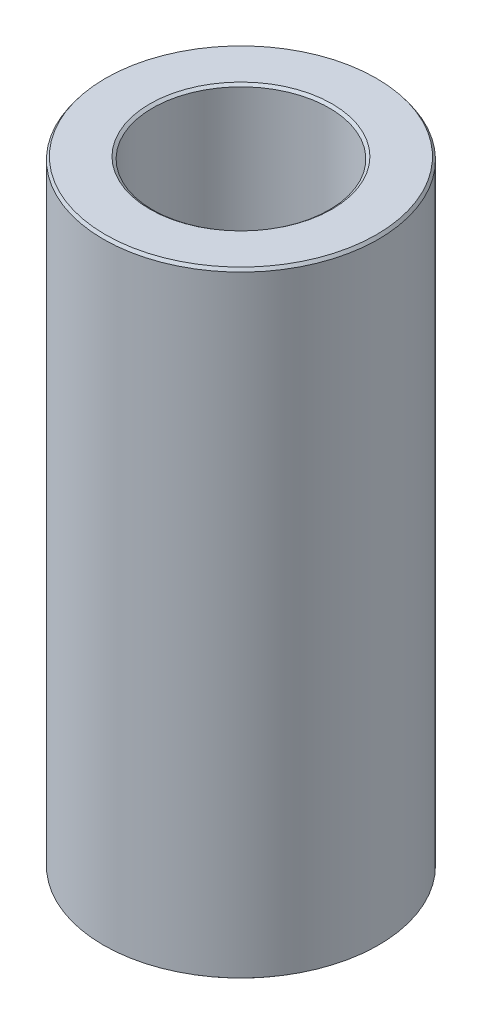
ISO-10303-21;
HEADER;
FILE_DESCRIPTION(('STEP AP214'),'2;1');
FILE_NAME('part.step','',(''),(''),'','','');
FILE_SCHEMA(('AUTOMOTIVE_DESIGN { 1 0 10303 214 1 1 1 1 }'));
ENDSEC;
DATA;
#1=APPLICATION_CONTEXT('core data for automotive mechanical design processes');
#2=APPLICATION_PROTOCOL_DEFINITION('international standard','automotive_design',2000,#1);
#3=PRODUCT_CONTEXT('',#1,'mechanical');
#4=PRODUCT('Part','Part','',(#3));
#5=PRODUCT_RELATED_PRODUCT_CATEGORY('part','',(#4));
#6=PRODUCT_DEFINITION_FORMATION('','',#4);
#7=PRODUCT_DEFINITION_CONTEXT('part definition',#1,'design');
#8=PRODUCT_DEFINITION('design','',#6,#7);
#9=PRODUCT_DEFINITION_SHAPE('','',#8);
#10=(LENGTH_UNIT() NAMED_UNIT(*) SI_UNIT(.MILLI.,.METRE.));
#11=(NAMED_UNIT(*) PLANE_ANGLE_UNIT() SI_UNIT($,.RADIAN.));
#12=(NAMED_UNIT(*) SI_UNIT($,.STERADIAN.) SOLID_ANGLE_UNIT());
#13=UNCERTAINTY_MEASURE_WITH_UNIT(LENGTH_MEASURE(1.E-05),#10,'distance_accuracy_value','');
#14=(GEOMETRIC_REPRESENTATION_CONTEXT(3) GLOBAL_UNCERTAINTY_ASSIGNED_CONTEXT((#13)) GLOBAL_UNIT_ASSIGNED_CONTEXT((#10,
#11,#12)) REPRESENTATION_CONTEXT('',''));
#15=CARTESIAN_POINT('',(0.,0.,0.));
#16=DIRECTION('',(0.,0.,1.));
#17=DIRECTION('',(1.,0.,0.));
#18=AXIS2_PLACEMENT_3D('',#15,#16,#17);
#19=CARTESIAN_POINT('',(0.,168.004298051566,0.));
#20=DIRECTION('',(0.,-1.,0.));
#21=DIRECTION('',(0.,0.,-1.));
#22=AXIS2_PLACEMENT_3D('',#19,#20,#21);
#23=CYLINDRICAL_SURFACE('',#22,37.5);
#24=CARTESIAN_POINT('',(0.,0.570369101469126,0.));
#25=DIRECTION('',(0.,1.,0.));
#26=DIRECTION('',(0.,0.,1.));
#27=AXIS2_PLACEMENT_3D('',#24,#25,#26);
#28=CIRCLE('',#27,37.5);
#29=CARTESIAN_POINT('',(0.,0.570369101469126,37.5));
#30=VERTEX_POINT('',#29);
#31=EDGE_CURVE('E10',#30,#30,#28,.T.);
#32=ORIENTED_EDGE('',*,*,#31,.T.);
#33=EDGE_LOOP('',(#32));
#34=FACE_BOUND('',#33,.T.);
#35=CARTESIAN_POINT('',(0.,167.219419827575,0.));
#36=DIRECTION('',(0.,1.,0.));
#37=DIRECTION('',(0.,0.,1.));
#38=AXIS2_PLACEMENT_3D('',#35,#36,#37);
#39=CIRCLE('',#38,37.5);
#40=CARTESIAN_POINT('',(0.,167.219419827575,37.5));
#41=VERTEX_POINT('',#40);
#42=EDGE_CURVE('E50',#41,#41,#39,.F.);
#43=ORIENTED_EDGE('',*,*,#42,.T.);
#44=EDGE_LOOP('',(#43));
#45=FACE_BOUND('',#44,.T.);
#46=ADVANCED_FACE('F39',(#34,#45),#23,.T.);
#47=CARTESIAN_POINT('',(0.,168.004298051566,0.));
#48=DIRECTION('',(0.,1.,0.));
#49=DIRECTION('',(0.,0.,1.));
#50=AXIS2_PLACEMENT_3D('',#47,#48,#49);
#51=PLANE('',#50);
#52=CARTESIAN_POINT('',(0.,168.004298051566,0.));
#53=DIRECTION('',(0.,1.,0.));
#54=DIRECTION('',(0.,0.,1.));
#55=AXIS2_PLACEMENT_3D('',#52,#53,#54);
#56=CIRCLE('',#55,24.8607305354559);
#57=CARTESIAN_POINT('',(0.,168.004298051566,24.8607305354559));
#58=VERTEX_POINT('',#57);
#59=EDGE_CURVE('E58',#58,#58,#56,.F.);
#60=ORIENTED_EDGE('',*,*,#59,.T.);
#61=EDGE_LOOP('',(#60));
#62=FACE_BOUND('',#61,.T.);
#63=CARTESIAN_POINT('',(0.,168.004298051566,0.));
#64=DIRECTION('',(0.,1.,0.));
#65=DIRECTION('',(0.,0.,1.));
#66=AXIS2_PLACEMENT_3D('',#63,#64,#65);
#67=CIRCLE('',#66,36.9296308985308);
#68=CARTESIAN_POINT('',(0.,168.004298051566,36.9296308985308));
#69=VERTEX_POINT('',#68);
#70=EDGE_CURVE('E61',#69,#69,#67,.T.);
#71=ORIENTED_EDGE('',*,*,#70,.T.);
#72=EDGE_LOOP('',(#71));
#73=FACE_BOUND('',#72,.T.);
#74=ADVANCED_FACE('F88',(#62,#73),#51,.T.);
#75=CARTESIAN_POINT('',(0.,0.,0.));
#76=DIRECTION('',(0.,1.,0.));
#77=DIRECTION('',(0.,0.,1.));
#78=AXIS2_PLACEMENT_3D('',#75,#76,#77);
#79=PLANE('',#78);
#80=CARTESIAN_POINT('',(0.,0.,0.));
#81=DIRECTION('',(0.,1.,0.));
#82=DIRECTION('',(0.,0.,1.));
#83=AXIS2_PLACEMENT_3D('',#80,#81,#82);
#84=CIRCLE('',#83,24.6462214129339);
#85=CARTESIAN_POINT('',(0.,0.,24.6462214129339));
#86=VERTEX_POINT('',#85);
#87=EDGE_CURVE('E51',#86,#86,#84,.T.);
#88=ORIENTED_EDGE('',*,*,#87,.T.);
#89=EDGE_LOOP('',(#88));
#90=FACE_BOUND('',#89,.T.);
#91=CARTESIAN_POINT('',(0.,0.,0.));
#92=DIRECTION('',(0.,1.,0.));
#93=DIRECTION('',(0.,0.,1.));
#94=AXIS2_PLACEMENT_3D('',#91,#92,#93);
#95=CIRCLE('',#94,36.7151217760088);
#96=CARTESIAN_POINT('',(0.,0.,36.7151217760088));
#97=VERTEX_POINT('',#96);
#98=EDGE_CURVE('E54',#97,#97,#95,.F.);
#99=ORIENTED_EDGE('',*,*,#98,.T.);
#100=EDGE_LOOP('',(#99));
#101=FACE_BOUND('',#100,.T.);
#102=ADVANCED_FACE('F83',(#90,#101),#79,.F.);
#103=CARTESIAN_POINT('',(0.,168.004298051566,0.));
#104=DIRECTION('',(0.,-1.,0.));
#105=DIRECTION('',(0.,0.,-1.));
#106=AXIS2_PLACEMENT_3D('',#103,#104,#105);
#107=CYLINDRICAL_SURFACE('',#106,24.0758523114647);
#108=CARTESIAN_POINT('',(0.,167.433928950097,0.));
#109=DIRECTION('',(0.,1.,0.));
#110=DIRECTION('',(0.,0.,1.));
#111=AXIS2_PLACEMENT_3D('',#108,#109,#110);
#112=CIRCLE('',#111,24.0758523114647);
#113=CARTESIAN_POINT('',(0.,167.433928950097,24.0758523114647));
#114=VERTEX_POINT('',#113);
#115=EDGE_CURVE('E67',#114,#114,#112,.T.);
#116=ORIENTED_EDGE('',*,*,#115,.T.);
#117=EDGE_LOOP('',(#116));
#118=FACE_BOUND('',#117,.T.);
#119=CARTESIAN_POINT('',(0.,0.784878223991203,0.));
#120=DIRECTION('',(0.,1.,0.));
#121=DIRECTION('',(0.,0.,1.));
#122=AXIS2_PLACEMENT_3D('',#119,#120,#121);
#123=CIRCLE('',#122,24.0758523114647);
#124=CARTESIAN_POINT('',(0.,0.784878223991203,24.0758523114647));
#125=VERTEX_POINT('',#124);
#126=EDGE_CURVE('E69',#125,#125,#123,.F.);
#127=ORIENTED_EDGE('',*,*,#126,.T.);
#128=EDGE_LOOP('',(#127));
#129=FACE_BOUND('',#128,.T.);
#130=ADVANCED_FACE('F71',(#118,#129),#107,.F.);
#131=CARTESIAN_POINT('',(0.,167.433928950097,0.));
#132=DIRECTION('',(0.,1.,0.));
#133=DIRECTION('',(0.,0.,1.));
#134=AXIS2_PLACEMENT_3D('',#131,#132,#133);
#135=CONICAL_SURFACE('',#134,24.0758523114647,0.942376324463179);
#136=ORIENTED_EDGE('',*,*,#59,.F.);
#137=EDGE_LOOP('',(#136));
#138=FACE_BOUND('',#137,.T.);
#139=ORIENTED_EDGE('',*,*,#115,.F.);
#140=EDGE_LOOP('',(#139));
#141=FACE_BOUND('',#140,.T.);
#142=ADVANCED_FACE('F77',(#138,#141),#135,.F.);
#143=CARTESIAN_POINT('',(0.,0.,0.));
#144=DIRECTION('',(0.,-1.,0.));
#145=DIRECTION('',(0.,0.,-1.));
#146=AXIS2_PLACEMENT_3D('',#143,#144,#145);
#147=CONICAL_SURFACE('',#146,24.6462214129339,0.628420002331729);
#148=ORIENTED_EDGE('',*,*,#126,.F.);
#149=EDGE_LOOP('',(#148));
#150=FACE_BOUND('',#149,.T.);
#151=ORIENTED_EDGE('',*,*,#87,.F.);
#152=EDGE_LOOP('',(#151));
#153=FACE_BOUND('',#152,.T.);
#154=ADVANCED_FACE('F73',(#150,#153),#147,.F.);
#155=CARTESIAN_POINT('',(0.,0.570369101469126,0.));
#156=DIRECTION('',(0.,1.,0.));
#157=DIRECTION('',(0.,0.,1.));
#158=AXIS2_PLACEMENT_3D('',#155,#156,#157);
#159=CONICAL_SURFACE('',#158,37.5,0.942376324463185);
#160=ORIENTED_EDGE('',*,*,#98,.F.);
#161=EDGE_LOOP('',(#160));
#162=FACE_BOUND('',#161,.T.);
#163=ORIENTED_EDGE('',*,*,#31,.F.);
#164=EDGE_LOOP('',(#163));
#165=FACE_BOUND('',#164,.T.);
#166=ADVANCED_FACE('F76',(#162,#165),#159,.T.);
#167=CARTESIAN_POINT('',(0.,168.004298051566,0.));
#168=DIRECTION('',(0.,-1.,0.));
#169=DIRECTION('',(0.,0.,-1.));
#170=AXIS2_PLACEMENT_3D('',#167,#168,#169);
#171=CONICAL_SURFACE('',#170,36.9296308985308,0.628420002331729);
#172=ORIENTED_EDGE('',*,*,#42,.F.);
#173=EDGE_LOOP('',(#172));
#174=FACE_BOUND('',#173,.T.);
#175=ORIENTED_EDGE('',*,*,#70,.F.);
#176=EDGE_LOOP('',(#175));
#177=FACE_BOUND('',#176,.T.);
#178=ADVANCED_FACE('F45',(#174,#177),#171,.T.);
#179=CLOSED_SHELL('',(#46,#74,#102,#130,#142,#154,#166,#178));
#180=MANIFOLD_SOLID_BREP('B2',#179);
#181=ADVANCED_BREP_SHAPE_REPRESENTATION('',(#18,#180),#14);
#182=SHAPE_DEFINITION_REPRESENTATION(#9,#181);
ENDSEC;
END-ISO-10303-21;
